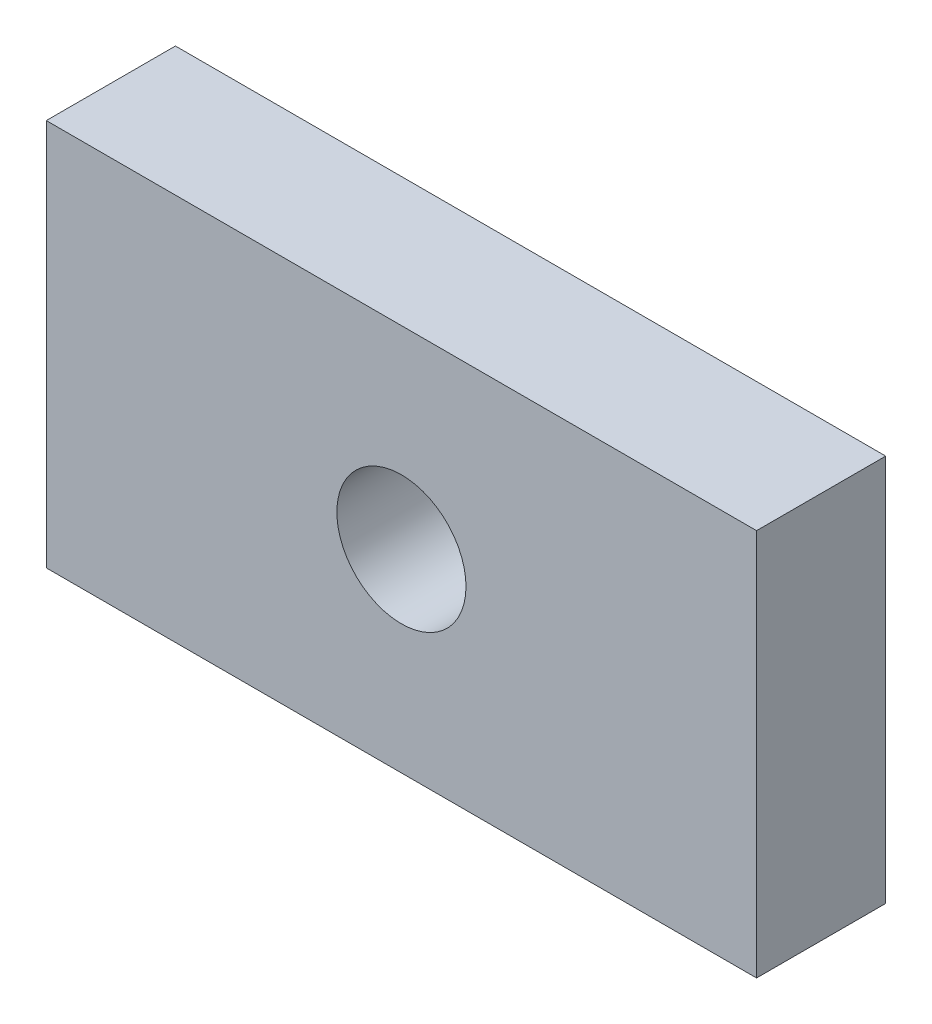
ISO-10303-21;
HEADER;
FILE_DESCRIPTION(('STEP AP214'),'2;1');
FILE_NAME('part.step','',(''),(''),'','','');
FILE_SCHEMA(('AUTOMOTIVE_DESIGN { 1 0 10303 214 1 1 1 1 }'));
ENDSEC;
DATA;
#1=APPLICATION_CONTEXT('core data for automotive mechanical design processes');
#2=APPLICATION_PROTOCOL_DEFINITION('international standard','automotive_design',2000,#1);
#3=PRODUCT_CONTEXT('',#1,'mechanical');
#4=PRODUCT('Part','Part','',(#3));
#5=PRODUCT_RELATED_PRODUCT_CATEGORY('part','',(#4));
#6=PRODUCT_DEFINITION_FORMATION('','',#4);
#7=PRODUCT_DEFINITION_CONTEXT('part definition',#1,'design');
#8=PRODUCT_DEFINITION('design','',#6,#7);
#9=PRODUCT_DEFINITION_SHAPE('','',#8);
#10=(LENGTH_UNIT() NAMED_UNIT(*) SI_UNIT(.MILLI.,.METRE.));
#11=(NAMED_UNIT(*) PLANE_ANGLE_UNIT() SI_UNIT($,.RADIAN.));
#12=(NAMED_UNIT(*) SI_UNIT($,.STERADIAN.) SOLID_ANGLE_UNIT());
#13=UNCERTAINTY_MEASURE_WITH_UNIT(LENGTH_MEASURE(1.E-05),#10,'distance_accuracy_value','');
#14=(GEOMETRIC_REPRESENTATION_CONTEXT(3) GLOBAL_UNCERTAINTY_ASSIGNED_CONTEXT((#13)) GLOBAL_UNIT_ASSIGNED_CONTEXT((#10,
#11,#12)) REPRESENTATION_CONTEXT('',''));
#15=CARTESIAN_POINT('',(0.,0.,0.));
#16=DIRECTION('',(0.,0.,1.));
#17=DIRECTION('',(1.,0.,0.));
#18=AXIS2_PLACEMENT_3D('',#15,#16,#17);
#19=CARTESIAN_POINT('',(0.,0.,25.4));
#20=DIRECTION('',(0.,0.,1.));
#21=DIRECTION('',(1.,0.,0.));
#22=AXIS2_PLACEMENT_3D('',#19,#20,#21);
#23=PLANE('',#22);
#24=DIRECTION('',(0.,-1.,0.));
#25=VECTOR('',#24,1.);
#26=CARTESIAN_POINT('',(-69.85,38.1,25.4));
#27=LINE('',#26,#25);
#28=CARTESIAN_POINT('',(-69.85,38.1,25.4));
#29=VERTEX_POINT('',#28);
#30=CARTESIAN_POINT('',(-69.85,-38.1,25.4));
#31=VERTEX_POINT('',#30);
#32=EDGE_CURVE('E92',#29,#31,#27,.T.);
#33=ORIENTED_EDGE('',*,*,#32,.T.);
#34=DIRECTION('',(1.,0.,0.));
#35=VECTOR('',#34,1.);
#36=CARTESIAN_POINT('',(-69.85,-38.1,25.4));
#37=LINE('',#36,#35);
#38=CARTESIAN_POINT('',(69.85,-38.1,25.4));
#39=VERTEX_POINT('',#38);
#40=EDGE_CURVE('E87',#31,#39,#37,.T.);
#41=ORIENTED_EDGE('',*,*,#40,.T.);
#42=DIRECTION('',(0.,1.,0.));
#43=VECTOR('',#42,1.);
#44=CARTESIAN_POINT('',(69.85,38.1,25.4));
#45=LINE('',#44,#43);
#46=CARTESIAN_POINT('',(69.85,38.1,25.4));
#47=VERTEX_POINT('',#46);
#48=EDGE_CURVE('E90',#39,#47,#45,.T.);
#49=ORIENTED_EDGE('',*,*,#48,.T.);
#50=DIRECTION('',(-1.,0.,0.));
#51=VECTOR('',#50,1.);
#52=CARTESIAN_POINT('',(-69.85,38.1,25.4));
#53=LINE('',#52,#51);
#54=EDGE_CURVE('E57',#47,#29,#53,.T.);
#55=ORIENTED_EDGE('',*,*,#54,.T.);
#56=EDGE_LOOP('',(#33,#41,#49,#55));
#57=FACE_BOUND('',#56,.T.);
#58=CARTESIAN_POINT('',(0.,0.,25.4));
#59=DIRECTION('',(0.,0.,1.));
#60=DIRECTION('',(1.,0.,0.));
#61=AXIS2_PLACEMENT_3D('',#58,#59,#60);
#62=CIRCLE('',#61,12.7);
#63=CARTESIAN_POINT('',(12.7,0.,25.4));
#64=VERTEX_POINT('',#63);
#65=EDGE_CURVE('E112',#64,#64,#62,.T.);
#66=ORIENTED_EDGE('',*,*,#65,.F.);
#67=EDGE_LOOP('',(#66));
#68=FACE_BOUND('',#67,.T.);
#69=ADVANCED_FACE('F39',(#57,#68),#23,.T.);
#70=CARTESIAN_POINT('',(0.,0.,0.));
#71=DIRECTION('',(0.,0.,1.));
#72=DIRECTION('',(1.,0.,0.));
#73=AXIS2_PLACEMENT_3D('',#70,#71,#72);
#74=PLANE('',#73);
#75=DIRECTION('',(0.,-1.,0.));
#76=VECTOR('',#75,1.);
#77=CARTESIAN_POINT('',(-69.85,38.1,0.));
#78=LINE('',#77,#76);
#79=CARTESIAN_POINT('',(-69.85,38.1,0.));
#80=VERTEX_POINT('',#79);
#81=CARTESIAN_POINT('',(-69.85,-38.1,0.));
#82=VERTEX_POINT('',#81);
#83=EDGE_CURVE('E108',#80,#82,#78,.T.);
#84=ORIENTED_EDGE('',*,*,#83,.F.);
#85=DIRECTION('',(-1.,0.,0.));
#86=VECTOR('',#85,1.);
#87=CARTESIAN_POINT('',(-69.85,38.1,0.));
#88=LINE('',#87,#86);
#89=CARTESIAN_POINT('',(69.85,38.1,0.));
#90=VERTEX_POINT('',#89);
#91=EDGE_CURVE('E80',#90,#80,#88,.T.);
#92=ORIENTED_EDGE('',*,*,#91,.F.);
#93=DIRECTION('',(0.,1.,0.));
#94=VECTOR('',#93,1.);
#95=CARTESIAN_POINT('',(69.85,38.1,0.));
#96=LINE('',#95,#94);
#97=CARTESIAN_POINT('',(69.85,-38.1,0.));
#98=VERTEX_POINT('',#97);
#99=EDGE_CURVE('E74',#98,#90,#96,.T.);
#100=ORIENTED_EDGE('',*,*,#99,.F.);
#101=DIRECTION('',(1.,0.,0.));
#102=VECTOR('',#101,1.);
#103=CARTESIAN_POINT('',(-69.85,-38.1,0.));
#104=LINE('',#103,#102);
#105=EDGE_CURVE('E97',#82,#98,#104,.T.);
#106=ORIENTED_EDGE('',*,*,#105,.F.);
#107=EDGE_LOOP('',(#84,#92,#100,#106));
#108=FACE_BOUND('',#107,.T.);
#109=CARTESIAN_POINT('',(0.,0.,0.));
#110=DIRECTION('',(0.,0.,1.));
#111=DIRECTION('',(1.,0.,0.));
#112=AXIS2_PLACEMENT_3D('',#109,#110,#111);
#113=CIRCLE('',#112,12.7);
#114=CARTESIAN_POINT('',(12.7,0.,0.));
#115=VERTEX_POINT('',#114);
#116=EDGE_CURVE('E130',#115,#115,#113,.T.);
#117=ORIENTED_EDGE('',*,*,#116,.T.);
#118=EDGE_LOOP('',(#117));
#119=FACE_BOUND('',#118,.T.);
#120=ADVANCED_FACE('F125',(#108,#119),#74,.F.);
#121=CARTESIAN_POINT('',(-69.85,38.1,25.4));
#122=DIRECTION('',(1.,0.,0.));
#123=DIRECTION('',(0.,0.,-1.));
#124=AXIS2_PLACEMENT_3D('',#121,#122,#123);
#125=PLANE('',#124);
#126=ORIENTED_EDGE('',*,*,#83,.T.);
#127=DIRECTION('',(0.,0.,-1.));
#128=VECTOR('',#127,1.);
#129=CARTESIAN_POINT('',(-69.85,-38.1,25.4));
#130=LINE('',#129,#128);
#131=EDGE_CURVE('E11',#31,#82,#130,.T.);
#132=ORIENTED_EDGE('',*,*,#131,.F.);
#133=ORIENTED_EDGE('',*,*,#32,.F.);
#134=DIRECTION('',(0.,0.,-1.));
#135=VECTOR('',#134,1.);
#136=CARTESIAN_POINT('',(-69.85,38.1,25.4));
#137=LINE('',#136,#135);
#138=EDGE_CURVE('E104',#29,#80,#137,.T.);
#139=ORIENTED_EDGE('',*,*,#138,.T.);
#140=EDGE_LOOP('',(#126,#132,#133,#139));
#141=FACE_BOUND('',#140,.T.);
#142=ADVANCED_FACE('F41',(#141),#125,.F.);
#143=CARTESIAN_POINT('',(-69.85,-38.1,25.4));
#144=DIRECTION('',(0.,1.,0.));
#145=DIRECTION('',(-1.,0.,0.));
#146=AXIS2_PLACEMENT_3D('',#143,#144,#145);
#147=PLANE('',#146);
#148=ORIENTED_EDGE('',*,*,#105,.T.);
#149=DIRECTION('',(0.,0.,-1.));
#150=VECTOR('',#149,1.);
#151=CARTESIAN_POINT('',(69.85,-38.1,25.4));
#152=LINE('',#151,#150);
#153=EDGE_CURVE('E49',#39,#98,#152,.T.);
#154=ORIENTED_EDGE('',*,*,#153,.F.);
#155=ORIENTED_EDGE('',*,*,#40,.F.);
#156=ORIENTED_EDGE('',*,*,#131,.T.);
#157=EDGE_LOOP('',(#148,#154,#155,#156));
#158=FACE_BOUND('',#157,.T.);
#159=ADVANCED_FACE('F96',(#158),#147,.F.);
#160=CARTESIAN_POINT('',(69.85,38.1,25.4));
#161=DIRECTION('',(-1.,0.,0.));
#162=DIRECTION('',(0.,-1.,0.));
#163=AXIS2_PLACEMENT_3D('',#160,#161,#162);
#164=PLANE('',#163);
#165=ORIENTED_EDGE('',*,*,#99,.T.);
#166=DIRECTION('',(0.,0.,-1.));
#167=VECTOR('',#166,1.);
#168=CARTESIAN_POINT('',(69.85,38.1,25.4));
#169=LINE('',#168,#167);
#170=EDGE_CURVE('E99',#47,#90,#169,.T.);
#171=ORIENTED_EDGE('',*,*,#170,.F.);
#172=ORIENTED_EDGE('',*,*,#48,.F.);
#173=ORIENTED_EDGE('',*,*,#153,.T.);
#174=EDGE_LOOP('',(#165,#171,#172,#173));
#175=FACE_BOUND('',#174,.T.);
#176=ADVANCED_FACE('F100',(#175),#164,.F.);
#177=CARTESIAN_POINT('',(-69.85,38.1,25.4));
#178=DIRECTION('',(0.,-1.,0.));
#179=DIRECTION('',(0.,0.,-1.));
#180=AXIS2_PLACEMENT_3D('',#177,#178,#179);
#181=PLANE('',#180);
#182=ORIENTED_EDGE('',*,*,#91,.T.);
#183=ORIENTED_EDGE('',*,*,#138,.F.);
#184=ORIENTED_EDGE('',*,*,#54,.F.);
#185=ORIENTED_EDGE('',*,*,#170,.T.);
#186=EDGE_LOOP('',(#182,#183,#184,#185));
#187=FACE_BOUND('',#186,.T.);
#188=ADVANCED_FACE('F122',(#187),#181,.F.);
#189=CARTESIAN_POINT('',(0.,0.,25.4));
#190=DIRECTION('',(0.,0.,-1.));
#191=DIRECTION('',(-1.,0.,0.));
#192=AXIS2_PLACEMENT_3D('',#189,#190,#191);
#193=CYLINDRICAL_SURFACE('',#192,12.7);
#194=ORIENTED_EDGE('',*,*,#65,.T.);
#195=EDGE_LOOP('',(#194));
#196=FACE_BOUND('',#195,.T.);
#197=ORIENTED_EDGE('',*,*,#116,.F.);
#198=EDGE_LOOP('',(#197));
#199=FACE_BOUND('',#198,.T.);
#200=ADVANCED_FACE('F138',(#196,#199),#193,.F.);
#201=CLOSED_SHELL('',(#69,#120,#142,#159,#176,#188,#200));
#202=MANIFOLD_SOLID_BREP('B2',#201);
#203=ADVANCED_BREP_SHAPE_REPRESENTATION('',(#18,#202),#14);
#204=SHAPE_DEFINITION_REPRESENTATION(#9,#203);
ENDSEC;
END-ISO-10303-21;
